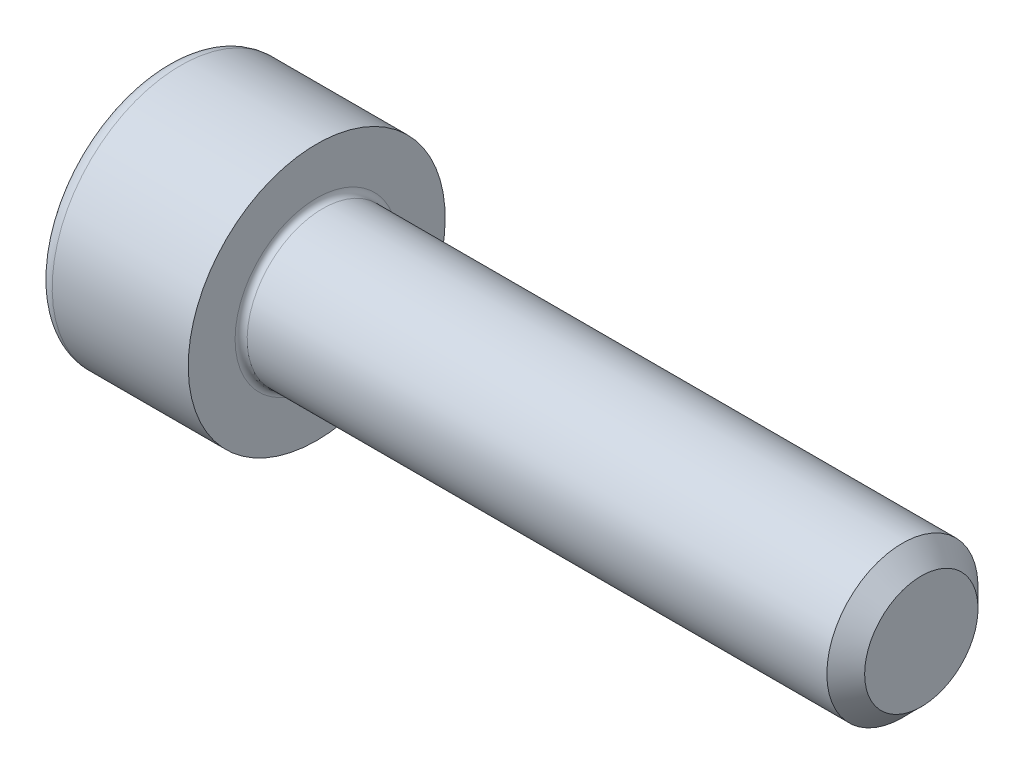
ISO-10303-21;
HEADER;
FILE_DESCRIPTION(('STEP AP214'),'2;1');
FILE_NAME('part.step','',(''),(''),'','','');
FILE_SCHEMA(('AUTOMOTIVE_DESIGN { 1 0 10303 214 1 1 1 1 }'));
ENDSEC;
DATA;
#1=APPLICATION_CONTEXT('core data for automotive mechanical design processes');
#2=APPLICATION_PROTOCOL_DEFINITION('international standard','automotive_design',2000,#1);
#3=PRODUCT_CONTEXT('',#1,'mechanical');
#4=PRODUCT('Part','Part','',(#3));
#5=PRODUCT_RELATED_PRODUCT_CATEGORY('part','',(#4));
#6=PRODUCT_DEFINITION_FORMATION('','',#4);
#7=PRODUCT_DEFINITION_CONTEXT('part definition',#1,'design');
#8=PRODUCT_DEFINITION('design','',#6,#7);
#9=PRODUCT_DEFINITION_SHAPE('','',#8);
#10=(LENGTH_UNIT() NAMED_UNIT(*) SI_UNIT(.MILLI.,.METRE.));
#11=(NAMED_UNIT(*) PLANE_ANGLE_UNIT() SI_UNIT($,.RADIAN.));
#12=(NAMED_UNIT(*) SI_UNIT($,.STERADIAN.) SOLID_ANGLE_UNIT());
#13=UNCERTAINTY_MEASURE_WITH_UNIT(LENGTH_MEASURE(1.E-05),#10,'distance_accuracy_value','');
#14=(GEOMETRIC_REPRESENTATION_CONTEXT(3) GLOBAL_UNCERTAINTY_ASSIGNED_CONTEXT((#13)) GLOBAL_UNIT_ASSIGNED_CONTEXT((#10,
#11,#12)) REPRESENTATION_CONTEXT('',''));
#15=CARTESIAN_POINT('',(0.,0.,0.));
#16=DIRECTION('',(0.,0.,1.));
#17=DIRECTION('',(1.,0.,0.));
#18=AXIS2_PLACEMENT_3D('',#15,#16,#17);
#19=CARTESIAN_POINT('',(-1.99999999995271,0.,0.));
#20=DIRECTION('',(-1.,0.,0.));
#21=DIRECTION('',(0.,0.,1.));
#22=AXIS2_PLACEMENT_3D('',#19,#20,#21);
#23=CONICAL_SURFACE('',#22,1.83319999985088,1.04719755109013);
#24=CARTESIAN_POINT('',(-0.941601486488253,-1.13686837721616E-10,0.));
#25=VERTEX_POINT('',#24);
#26=VERTEX_LOOP('',#25);
#27=FACE_BOUND('',#26,.T.);
#28=CARTESIAN_POINT('',(-2.00000000001834,0.,0.));
#29=DIRECTION('',(-1.,0.,0.));
#30=DIRECTION('',(0.,0.,1.));
#31=AXIS2_PLACEMENT_3D('',#28,#29,#30);
#32=CIRCLE('',#31,1.83319999996456);
#33=CARTESIAN_POINT('',(-2.00000000001834,-0.916599999982282,-1.58759777018694));
#34=VERTEX_POINT('',#33);
#35=CARTESIAN_POINT('',(-2.00000000001834,-1.83319999996456,0.));
#36=VERTEX_POINT('',#35);
#37=EDGE_CURVE('E89',#34,#36,#32,.T.);
#38=ORIENTED_EDGE('',*,*,#37,.T.);
#39=CARTESIAN_POINT('',(-2.00000000001834,0.,0.));
#40=DIRECTION('',(-1.,0.,0.));
#41=DIRECTION('',(0.,0.,1.));
#42=AXIS2_PLACEMENT_3D('',#39,#40,#41);
#43=CIRCLE('',#42,1.83319999996456);
#44=CARTESIAN_POINT('',(-2.00000000001834,-0.916599999982281,1.58759777018694));
#45=VERTEX_POINT('',#44);
#46=EDGE_CURVE('E84',#36,#45,#43,.T.);
#47=ORIENTED_EDGE('',*,*,#46,.T.);
#48=CARTESIAN_POINT('',(-2.00000000001834,0.,0.));
#49=DIRECTION('',(-1.,0.,0.));
#50=DIRECTION('',(0.,0.,1.));
#51=AXIS2_PLACEMENT_3D('',#48,#49,#50);
#52=CIRCLE('',#51,1.83319999996456);
#53=CARTESIAN_POINT('',(-1.99999999995271,0.916599999925436,1.58759777008849));
#54=VERTEX_POINT('',#53);
#55=EDGE_CURVE('E86',#45,#54,#52,.T.);
#56=ORIENTED_EDGE('',*,*,#55,.T.);
#57=CARTESIAN_POINT('',(-1.99999999995271,0.,0.));
#58=DIRECTION('',(-1.,0.,0.));
#59=DIRECTION('',(0.,0.,1.));
#60=AXIS2_PLACEMENT_3D('',#57,#58,#59);
#61=CIRCLE('',#60,1.83319999985088);
#62=CARTESIAN_POINT('',(-1.99999999995271,1.83319999985088,0.));
#63=VERTEX_POINT('',#62);
#64=EDGE_CURVE('E100',#54,#63,#61,.T.);
#65=ORIENTED_EDGE('',*,*,#64,.T.);
#66=CARTESIAN_POINT('',(-2.00000000001834,0.,0.));
#67=DIRECTION('',(-1.,0.,0.));
#68=DIRECTION('',(0.,0.,1.));
#69=AXIS2_PLACEMENT_3D('',#66,#67,#68);
#70=CIRCLE('',#69,1.83319999996456);
#71=CARTESIAN_POINT('',(-2.00000000001834,0.91659999998228,-1.58759777018694));
#72=VERTEX_POINT('',#71);
#73=EDGE_CURVE('E187',#63,#72,#70,.T.);
#74=ORIENTED_EDGE('',*,*,#73,.T.);
#75=CARTESIAN_POINT('',(-2.00000000001834,0.,0.));
#76=DIRECTION('',(-1.,0.,0.));
#77=DIRECTION('',(0.,0.,1.));
#78=AXIS2_PLACEMENT_3D('',#75,#76,#77);
#79=CIRCLE('',#78,1.83319999996456);
#80=EDGE_CURVE('E185',#72,#34,#79,.T.);
#81=ORIENTED_EDGE('',*,*,#80,.T.);
#82=EDGE_LOOP('',(#38,#47,#56,#65,#74,#81));
#83=FACE_BOUND('',#82,.T.);
#84=ADVANCED_FACE('F17',(#27,#83),#23,.F.);
#85=CARTESIAN_POINT('',(-2.,0.,0.));
#86=DIRECTION('',(-1.,0.,0.));
#87=DIRECTION('',(0.,-1.,0.));
#88=AXIS2_PLACEMENT_3D('',#85,#86,#87);
#89=PLANE('',#88);
#90=ORIENTED_EDGE('',*,*,#55,.F.);
#91=DIRECTION('',(0.,-1.,0.));
#92=VECTOR('',#91,1.);
#93=CARTESIAN_POINT('',(-2.,-0.9166,1.58759777021763));
#94=LINE('',#93,#92);
#95=EDGE_CURVE('E94',#45,#54,#94,.F.);
#96=ORIENTED_EDGE('',*,*,#95,.T.);
#97=EDGE_LOOP('',(#90,#96));
#98=FACE_BOUND('',#97,.T.);
#99=ADVANCED_FACE('F97',(#98),#89,.F.);
#100=CARTESIAN_POINT('',(-2.,0.,0.));
#101=DIRECTION('',(-1.,0.,0.));
#102=DIRECTION('',(0.,-1.,0.));
#103=AXIS2_PLACEMENT_3D('',#100,#101,#102);
#104=PLANE('',#103);
#105=ORIENTED_EDGE('',*,*,#64,.F.);
#106=DIRECTION('',(0.,-0.5,0.866025403784439));
#107=VECTOR('',#106,1.);
#108=CARTESIAN_POINT('',(-2.,0.9166,1.58759777021763));
#109=LINE('',#108,#107);
#110=EDGE_CURVE('E163',#54,#63,#109,.F.);
#111=ORIENTED_EDGE('',*,*,#110,.T.);
#112=EDGE_LOOP('',(#105,#111));
#113=FACE_BOUND('',#112,.T.);
#114=ADVANCED_FACE('F294',(#113),#104,.F.);
#115=CARTESIAN_POINT('',(-2.,0.,0.));
#116=DIRECTION('',(-1.,0.,0.));
#117=DIRECTION('',(0.,-1.,0.));
#118=AXIS2_PLACEMENT_3D('',#115,#116,#117);
#119=PLANE('',#118);
#120=ORIENTED_EDGE('',*,*,#73,.F.);
#121=DIRECTION('',(0.,0.5,0.866025403784439));
#122=VECTOR('',#121,1.);
#123=CARTESIAN_POINT('',(-2.,1.8332,0.));
#124=LINE('',#123,#122);
#125=EDGE_CURVE('E152',#63,#72,#124,.F.);
#126=ORIENTED_EDGE('',*,*,#125,.T.);
#127=EDGE_LOOP('',(#120,#126));
#128=FACE_BOUND('',#127,.T.);
#129=ADVANCED_FACE('F298',(#128),#119,.F.);
#130=CARTESIAN_POINT('',(-2.,0.,0.));
#131=DIRECTION('',(-1.,0.,0.));
#132=DIRECTION('',(0.,-1.,0.));
#133=AXIS2_PLACEMENT_3D('',#130,#131,#132);
#134=PLANE('',#133);
#135=ORIENTED_EDGE('',*,*,#80,.F.);
#136=DIRECTION('',(0.,1.,0.));
#137=VECTOR('',#136,1.);
#138=CARTESIAN_POINT('',(-2.,0.9166,-1.58759777021763));
#139=LINE('',#138,#137);
#140=EDGE_CURVE('E140',#72,#34,#139,.F.);
#141=ORIENTED_EDGE('',*,*,#140,.T.);
#142=EDGE_LOOP('',(#135,#141));
#143=FACE_BOUND('',#142,.T.);
#144=ADVANCED_FACE('F305',(#143),#134,.F.);
#145=CARTESIAN_POINT('',(-2.,0.,0.));
#146=DIRECTION('',(-1.,0.,0.));
#147=DIRECTION('',(0.,-1.,0.));
#148=AXIS2_PLACEMENT_3D('',#145,#146,#147);
#149=PLANE('',#148);
#150=ORIENTED_EDGE('',*,*,#37,.F.);
#151=DIRECTION('',(0.,0.5,-0.866025403784438));
#152=VECTOR('',#151,1.);
#153=CARTESIAN_POINT('',(-2.,-0.9166,-1.58759777021763));
#154=LINE('',#153,#152);
#155=EDGE_CURVE('E126',#34,#36,#154,.F.);
#156=ORIENTED_EDGE('',*,*,#155,.T.);
#157=EDGE_LOOP('',(#150,#156));
#158=FACE_BOUND('',#157,.T.);
#159=ADVANCED_FACE('F308',(#158),#149,.F.);
#160=CARTESIAN_POINT('',(-2.,0.,0.));
#161=DIRECTION('',(-1.,0.,0.));
#162=DIRECTION('',(0.,-1.,0.));
#163=AXIS2_PLACEMENT_3D('',#160,#161,#162);
#164=PLANE('',#163);
#165=ORIENTED_EDGE('',*,*,#46,.F.);
#166=DIRECTION('',(0.,-0.5,-0.866025403784438));
#167=VECTOR('',#166,1.);
#168=CARTESIAN_POINT('',(-2.,-1.8332,0.));
#169=LINE('',#168,#167);
#170=EDGE_CURVE('E102',#36,#45,#169,.F.);
#171=ORIENTED_EDGE('',*,*,#170,.T.);
#172=EDGE_LOOP('',(#165,#171));
#173=FACE_BOUND('',#172,.T.);
#174=ADVANCED_FACE('F103',(#173),#164,.F.);
#175=CARTESIAN_POINT('',(-2.,-0.9166,1.58759777021763));
#176=DIRECTION('',(0.,0.,1.));
#177=DIRECTION('',(0.,-1.,0.));
#178=AXIS2_PLACEMENT_3D('',#175,#176,#177);
#179=PLANE('',#178);
#180=DIRECTION('',(1.,0.,0.));
#181=VECTOR('',#180,1.);
#182=CARTESIAN_POINT('',(-2.,0.9166,1.58759777021763));
#183=LINE('',#182,#181);
#184=CARTESIAN_POINT('',(-4.,0.916599999999999,1.58759777021763));
#185=VERTEX_POINT('',#184);
#186=EDGE_CURVE('E114',#185,#54,#183,.T.);
#187=ORIENTED_EDGE('',*,*,#186,.T.);
#188=ORIENTED_EDGE('',*,*,#95,.F.);
#189=DIRECTION('',(1.,0.,0.));
#190=VECTOR('',#189,1.);
#191=CARTESIAN_POINT('',(-2.,-0.9166,1.58759777021763));
#192=LINE('',#191,#190);
#193=CARTESIAN_POINT('',(-4.,-0.9166,1.58759777021763));
#194=VERTEX_POINT('',#193);
#195=EDGE_CURVE('E107',#45,#194,#192,.F.);
#196=ORIENTED_EDGE('',*,*,#195,.T.);
#197=DIRECTION('',(0.,1.,0.));
#198=VECTOR('',#197,1.);
#199=CARTESIAN_POINT('',(-4.,1.8332,1.58759777021763));
#200=LINE('',#199,#198);
#201=EDGE_CURVE('E121',#194,#185,#200,.T.);
#202=ORIENTED_EDGE('',*,*,#201,.T.);
#203=EDGE_LOOP('',(#187,#188,#196,#202));
#204=FACE_BOUND('',#203,.T.);
#205=ADVANCED_FACE('F111',(#204),#179,.F.);
#206=CARTESIAN_POINT('',(-2.,0.9166,1.58759777021763));
#207=DIRECTION('',(0.,0.866025403784439,0.5));
#208=DIRECTION('',(0.,-0.5,0.866025403784439));
#209=AXIS2_PLACEMENT_3D('',#206,#207,#208);
#210=PLANE('',#209);
#211=DIRECTION('',(1.,0.,0.));
#212=VECTOR('',#211,1.);
#213=CARTESIAN_POINT('',(-2.,1.8332,0.));
#214=LINE('',#213,#212);
#215=CARTESIAN_POINT('',(-4.,1.8332,0.));
#216=VERTEX_POINT('',#215);
#217=EDGE_CURVE('E157',#216,#63,#214,.T.);
#218=ORIENTED_EDGE('',*,*,#217,.T.);
#219=ORIENTED_EDGE('',*,*,#110,.F.);
#220=ORIENTED_EDGE('',*,*,#186,.F.);
#221=DIRECTION('',(0.,0.500000000000001,-0.866025403784438));
#222=VECTOR('',#221,1.);
#223=CARTESIAN_POINT('',(-4.,0.9166,1.58759777021763));
#224=LINE('',#223,#222);
#225=EDGE_CURVE('E123',#185,#216,#224,.T.);
#226=ORIENTED_EDGE('',*,*,#225,.T.);
#227=EDGE_LOOP('',(#218,#219,#220,#226));
#228=FACE_BOUND('',#227,.T.);
#229=ADVANCED_FACE('F290',(#228),#210,.F.);
#230=CARTESIAN_POINT('',(-2.,1.8332,0.));
#231=DIRECTION('',(0.,0.866025403784439,-0.5));
#232=DIRECTION('',(0.,0.5,0.866025403784439));
#233=AXIS2_PLACEMENT_3D('',#230,#231,#232);
#234=PLANE('',#233);
#235=DIRECTION('',(1.,0.,0.));
#236=VECTOR('',#235,1.);
#237=CARTESIAN_POINT('',(-2.,0.9166,-1.58759777021763));
#238=LINE('',#237,#236);
#239=CARTESIAN_POINT('',(-4.,0.9166,-1.58759777021763));
#240=VERTEX_POINT('',#239);
#241=EDGE_CURVE('E145',#240,#72,#238,.T.);
#242=ORIENTED_EDGE('',*,*,#241,.T.);
#243=ORIENTED_EDGE('',*,*,#125,.F.);
#244=ORIENTED_EDGE('',*,*,#217,.F.);
#245=DIRECTION('',(0.,-0.499999999999999,-0.866025403784439));
#246=VECTOR('',#245,1.);
#247=CARTESIAN_POINT('',(-4.,1.8332,0.));
#248=LINE('',#247,#246);
#249=EDGE_CURVE('E147',#216,#240,#248,.T.);
#250=ORIENTED_EDGE('',*,*,#249,.T.);
#251=EDGE_LOOP('',(#242,#243,#244,#250));
#252=FACE_BOUND('',#251,.T.);
#253=ADVANCED_FACE('F301',(#252),#234,.F.);
#254=CARTESIAN_POINT('',(-2.,0.9166,-1.58759777021763));
#255=DIRECTION('',(0.,0.,-1.));
#256=DIRECTION('',(0.,1.,0.));
#257=AXIS2_PLACEMENT_3D('',#254,#255,#256);
#258=PLANE('',#257);
#259=DIRECTION('',(1.,0.,0.));
#260=VECTOR('',#259,1.);
#261=CARTESIAN_POINT('',(-2.,-0.9166,-1.58759777021763));
#262=LINE('',#261,#260);
#263=CARTESIAN_POINT('',(-4.,-0.9166,-1.58759777021763));
#264=VERTEX_POINT('',#263);
#265=EDGE_CURVE('E128',#264,#34,#262,.T.);
#266=ORIENTED_EDGE('',*,*,#265,.T.);
#267=ORIENTED_EDGE('',*,*,#140,.F.);
#268=ORIENTED_EDGE('',*,*,#241,.F.);
#269=DIRECTION('',(0.,1.,0.));
#270=VECTOR('',#269,1.);
#271=CARTESIAN_POINT('',(-4.,1.8332,-1.58759777021763));
#272=LINE('',#271,#270);
#273=EDGE_CURVE('E131',#240,#264,#272,.F.);
#274=ORIENTED_EDGE('',*,*,#273,.T.);
#275=EDGE_LOOP('',(#266,#267,#268,#274));
#276=FACE_BOUND('',#275,.T.);
#277=ADVANCED_FACE('F306',(#276),#258,.F.);
#278=CARTESIAN_POINT('',(-2.,-0.9166,-1.58759777021763));
#279=DIRECTION('',(0.,-0.866025403784438,-0.5));
#280=DIRECTION('',(0.,0.5,-0.866025403784438));
#281=AXIS2_PLACEMENT_3D('',#278,#279,#280);
#282=PLANE('',#281);
#283=DIRECTION('',(1.,0.,0.));
#284=VECTOR('',#283,1.);
#285=CARTESIAN_POINT('',(-2.,-1.8332,0.));
#286=LINE('',#285,#284);
#287=CARTESIAN_POINT('',(-4.,-1.8332,0.));
#288=VERTEX_POINT('',#287);
#289=EDGE_CURVE('E108',#288,#36,#286,.T.);
#290=ORIENTED_EDGE('',*,*,#289,.T.);
#291=ORIENTED_EDGE('',*,*,#155,.F.);
#292=ORIENTED_EDGE('',*,*,#265,.F.);
#293=DIRECTION('',(0.,-0.5,0.866025403784439));
#294=VECTOR('',#293,1.);
#295=CARTESIAN_POINT('',(-4.,-0.9166,-1.58759777021763));
#296=LINE('',#295,#294);
#297=EDGE_CURVE('E129',#264,#288,#296,.T.);
#298=ORIENTED_EDGE('',*,*,#297,.T.);
#299=EDGE_LOOP('',(#290,#291,#292,#298));
#300=FACE_BOUND('',#299,.T.);
#301=ADVANCED_FACE('F281',(#300),#282,.F.);
#302=CARTESIAN_POINT('',(-2.,-1.8332,0.));
#303=DIRECTION('',(0.,-0.866025403784438,0.5));
#304=DIRECTION('',(0.,-0.5,-0.866025403784438));
#305=AXIS2_PLACEMENT_3D('',#302,#303,#304);
#306=PLANE('',#305);
#307=ORIENTED_EDGE('',*,*,#195,.F.);
#308=ORIENTED_EDGE('',*,*,#170,.F.);
#309=ORIENTED_EDGE('',*,*,#289,.F.);
#310=DIRECTION('',(0.,0.5,0.866025403784439));
#311=VECTOR('',#310,1.);
#312=CARTESIAN_POINT('',(-4.,-1.8332,0.));
#313=LINE('',#312,#311);
#314=EDGE_CURVE('E119',#288,#194,#313,.T.);
#315=ORIENTED_EDGE('',*,*,#314,.T.);
#316=EDGE_LOOP('',(#307,#308,#309,#315));
#317=FACE_BOUND('',#316,.T.);
#318=ADVANCED_FACE('F117',(#317),#306,.F.);
#319=CARTESIAN_POINT('',(-4.,1.8332,0.));
#320=DIRECTION('',(1.,0.,0.));
#321=DIRECTION('',(0.,1.,0.));
#322=AXIS2_PLACEMENT_3D('',#319,#320,#321);
#323=PLANE('',#322);
#324=CARTESIAN_POINT('',(-4.,0.,0.));
#325=DIRECTION('',(1.,0.,0.));
#326=DIRECTION('',(0.,-1.,0.));
#327=AXIS2_PLACEMENT_3D('',#324,#325,#326);
#328=CIRCLE('',#327,3.);
#329=CARTESIAN_POINT('',(-4.,-3.,0.));
#330=VERTEX_POINT('',#329);
#331=CARTESIAN_POINT('',(-4.,3.,0.));
#332=VERTEX_POINT('',#331);
#333=EDGE_CURVE('E135',#330,#332,#328,.T.);
#334=ORIENTED_EDGE('',*,*,#333,.F.);
#335=CARTESIAN_POINT('',(-4.,0.,0.));
#336=DIRECTION('',(1.,0.,0.));
#337=DIRECTION('',(0.,1.,0.));
#338=AXIS2_PLACEMENT_3D('',#335,#336,#337);
#339=CIRCLE('',#338,3.);
#340=EDGE_CURVE('E250',#332,#330,#339,.T.);
#341=ORIENTED_EDGE('',*,*,#340,.F.);
#342=EDGE_LOOP('',(#334,#341));
#343=FACE_BOUND('',#342,.T.);
#344=ORIENTED_EDGE('',*,*,#297,.F.);
#345=ORIENTED_EDGE('',*,*,#273,.F.);
#346=ORIENTED_EDGE('',*,*,#249,.F.);
#347=ORIENTED_EDGE('',*,*,#225,.F.);
#348=ORIENTED_EDGE('',*,*,#201,.F.);
#349=ORIENTED_EDGE('',*,*,#314,.F.);
#350=EDGE_LOOP('',(#344,#345,#346,#347,#348,#349));
#351=FACE_BOUND('',#350,.T.);
#352=ADVANCED_FACE('F259',(#343,#351),#323,.F.);
#353=CARTESIAN_POINT('',(-3.6,0.,0.));
#354=DIRECTION('',(-1.,0.,0.));
#355=DIRECTION('',(0.,1.,0.));
#356=AXIS2_PLACEMENT_3D('',#353,#354,#355);
#357=TOROIDAL_SURFACE('',#356,3.,0.4);
#358=ORIENTED_EDGE('',*,*,#333,.T.);
#359=ORIENTED_EDGE('',*,*,#340,.T.);
#360=EDGE_LOOP('',(#358,#359));
#361=FACE_BOUND('',#360,.T.);
#362=CARTESIAN_POINT('',(-3.6,0.,0.));
#363=DIRECTION('',(-1.,0.,0.));
#364=DIRECTION('',(0.,-1.,0.));
#365=AXIS2_PLACEMENT_3D('',#362,#363,#364);
#366=CIRCLE('',#365,3.4);
#367=CARTESIAN_POINT('',(-3.6,-3.4,0.));
#368=VERTEX_POINT('',#367);
#369=EDGE_CURVE('E182',#368,#368,#366,.F.);
#370=ORIENTED_EDGE('',*,*,#369,.F.);
#371=EDGE_LOOP('',(#370));
#372=FACE_BOUND('',#371,.T.);
#373=ADVANCED_FACE('F254',(#361,#372),#357,.T.);
#374=CARTESIAN_POINT('',(-0.94160148652158,0.,0.));
#375=DIRECTION('',(-1.,0.,0.));
#376=DIRECTION('',(0.,-1.,0.));
#377=AXIS2_PLACEMENT_3D('',#374,#375,#376);
#378=CYLINDRICAL_SURFACE('',#377,3.4);
#379=ORIENTED_EDGE('',*,*,#369,.T.);
#380=EDGE_LOOP('',(#379));
#381=FACE_BOUND('',#380,.T.);
#382=CARTESIAN_POINT('',(0.,0.,0.));
#383=DIRECTION('',(-1.,0.,0.));
#384=DIRECTION('',(0.,-1.,0.));
#385=AXIS2_PLACEMENT_3D('',#382,#383,#384);
#386=CIRCLE('',#385,3.4);
#387=CARTESIAN_POINT('',(0.,-3.4,0.));
#388=VERTEX_POINT('',#387);
#389=EDGE_CURVE('E180',#388,#388,#386,.T.);
#390=ORIENTED_EDGE('',*,*,#389,.T.);
#391=EDGE_LOOP('',(#390));
#392=FACE_BOUND('',#391,.T.);
#393=ADVANCED_FACE('F258',(#381,#392),#378,.T.);
#394=CARTESIAN_POINT('',(16.,0.,0.));
#395=DIRECTION('',(1.,0.,0.));
#396=DIRECTION('',(0.,1.,0.));
#397=AXIS2_PLACEMENT_3D('',#394,#395,#396);
#398=PLANE('',#397);
#399=CARTESIAN_POINT('',(16.0000000000196,0.,0.));
#400=DIRECTION('',(-1.,0.,0.));
#401=DIRECTION('',(0.,0.,1.));
#402=AXIS2_PLACEMENT_3D('',#399,#400,#401);
#403=CIRCLE('',#402,1.50000000007822);
#404=CARTESIAN_POINT('',(16.0000000000196,0.,1.50000000007822));
#405=VERTEX_POINT('',#404);
#406=EDGE_CURVE('E176',#405,#405,#403,.T.);
#407=ORIENTED_EDGE('',*,*,#406,.F.);
#408=EDGE_LOOP('',(#407));
#409=FACE_BOUND('',#408,.T.);
#410=ADVANCED_FACE('F227',(#409),#398,.T.);
#411=CARTESIAN_POINT('',(0.,3.4,0.));
#412=DIRECTION('',(-1.,0.,0.));
#413=DIRECTION('',(0.,-1.,0.));
#414=AXIS2_PLACEMENT_3D('',#411,#412,#413);
#415=PLANE('',#414);
#416=CARTESIAN_POINT('',(0.,0.,0.));
#417=DIRECTION('',(1.,0.,0.));
#418=DIRECTION('',(0.,-1.,0.));
#419=AXIS2_PLACEMENT_3D('',#416,#417,#418);
#420=CIRCLE('',#419,2.16);
#421=CARTESIAN_POINT('',(0.,2.16,0.));
#422=VERTEX_POINT('',#421);
#423=CARTESIAN_POINT('',(0.,-2.16,0.));
#424=VERTEX_POINT('',#423);
#425=EDGE_CURVE('E179',#422,#424,#420,.F.);
#426=ORIENTED_EDGE('',*,*,#425,.T.);
#427=CARTESIAN_POINT('',(0.,0.,0.));
#428=DIRECTION('',(1.,0.,0.));
#429=DIRECTION('',(0.,1.,0.));
#430=AXIS2_PLACEMENT_3D('',#427,#428,#429);
#431=CIRCLE('',#430,2.16);
#432=EDGE_CURVE('E36',#424,#422,#431,.F.);
#433=ORIENTED_EDGE('',*,*,#432,.T.);
#434=EDGE_LOOP('',(#426,#433));
#435=FACE_BOUND('',#434,.T.);
#436=ORIENTED_EDGE('',*,*,#389,.F.);
#437=EDGE_LOOP('',(#436));
#438=FACE_BOUND('',#437,.T.);
#439=ADVANCED_FACE('F218',(#435,#438),#415,.F.);
#440=CARTESIAN_POINT('',(15.5000000000314,0.,0.));
#441=DIRECTION('',(-1.,0.,0.));
#442=DIRECTION('',(0.,0.,1.));
#443=AXIS2_PLACEMENT_3D('',#440,#441,#442);
#444=CONICAL_SURFACE('',#443,2.00000000006639,0.785398163397449);
#445=ORIENTED_EDGE('',*,*,#406,.T.);
#446=EDGE_LOOP('',(#445));
#447=FACE_BOUND('',#446,.T.);
#448=CARTESIAN_POINT('',(15.5,0.,0.));
#449=DIRECTION('',(-1.,0.,0.));
#450=DIRECTION('',(0.,-1.,0.));
#451=AXIS2_PLACEMENT_3D('',#448,#449,#450);
#452=CIRCLE('',#451,2.);
#453=CARTESIAN_POINT('',(15.5,-2.,0.));
#454=VERTEX_POINT('',#453);
#455=EDGE_CURVE('E28',#454,#454,#452,.T.);
#456=ORIENTED_EDGE('',*,*,#455,.F.);
#457=EDGE_LOOP('',(#456));
#458=FACE_BOUND('',#457,.T.);
#459=ADVANCED_FACE('F207',(#447,#458),#444,.T.);
#460=CARTESIAN_POINT('',(0.16,0.,0.));
#461=DIRECTION('',(-1.,0.,0.));
#462=DIRECTION('',(0.,1.,0.));
#463=AXIS2_PLACEMENT_3D('',#460,#461,#462);
#464=TOROIDAL_SURFACE('',#463,2.16,0.16);
#465=CARTESIAN_POINT('',(0.16,0.,0.));
#466=DIRECTION('',(-1.,0.,0.));
#467=DIRECTION('',(0.,-1.,0.));
#468=AXIS2_PLACEMENT_3D('',#465,#466,#467);
#469=CIRCLE('',#468,2.);
#470=CARTESIAN_POINT('',(0.16,-2.,0.));
#471=VERTEX_POINT('',#470);
#472=EDGE_CURVE('E10',#471,#471,#469,.F.);
#473=ORIENTED_EDGE('',*,*,#472,.F.);
#474=EDGE_LOOP('',(#473));
#475=FACE_BOUND('',#474,.T.);
#476=ORIENTED_EDGE('',*,*,#425,.F.);
#477=ORIENTED_EDGE('',*,*,#432,.F.);
#478=EDGE_LOOP('',(#476,#477));
#479=FACE_BOUND('',#478,.T.);
#480=ADVANCED_FACE('F195',(#475,#479),#464,.F.);
#481=CARTESIAN_POINT('',(-0.94160148652158,0.,0.));
#482=DIRECTION('',(-1.,0.,0.));
#483=DIRECTION('',(0.,-1.,0.));
#484=AXIS2_PLACEMENT_3D('',#481,#482,#483);
#485=CYLINDRICAL_SURFACE('',#484,2.);
#486=ORIENTED_EDGE('',*,*,#472,.T.);
#487=EDGE_LOOP('',(#486));
#488=FACE_BOUND('',#487,.T.);
#489=ORIENTED_EDGE('',*,*,#455,.T.);
#490=EDGE_LOOP('',(#489));
#491=FACE_BOUND('',#490,.T.);
#492=ADVANCED_FACE('F206',(#488,#491),#485,.T.);
#493=CLOSED_SHELL('',(#84,#99,#114,#129,#144,#159,#174,#205,#229,#253,#277,#301,#318,#352,#373,
#393,#410,#439,#459,#480,#492));
#494=MANIFOLD_SOLID_BREP('B1',#493);
#495=ADVANCED_BREP_SHAPE_REPRESENTATION('',(#18,#494),#14);
#496=SHAPE_DEFINITION_REPRESENTATION(#9,#495);
ENDSEC;
END-ISO-10303-21;
